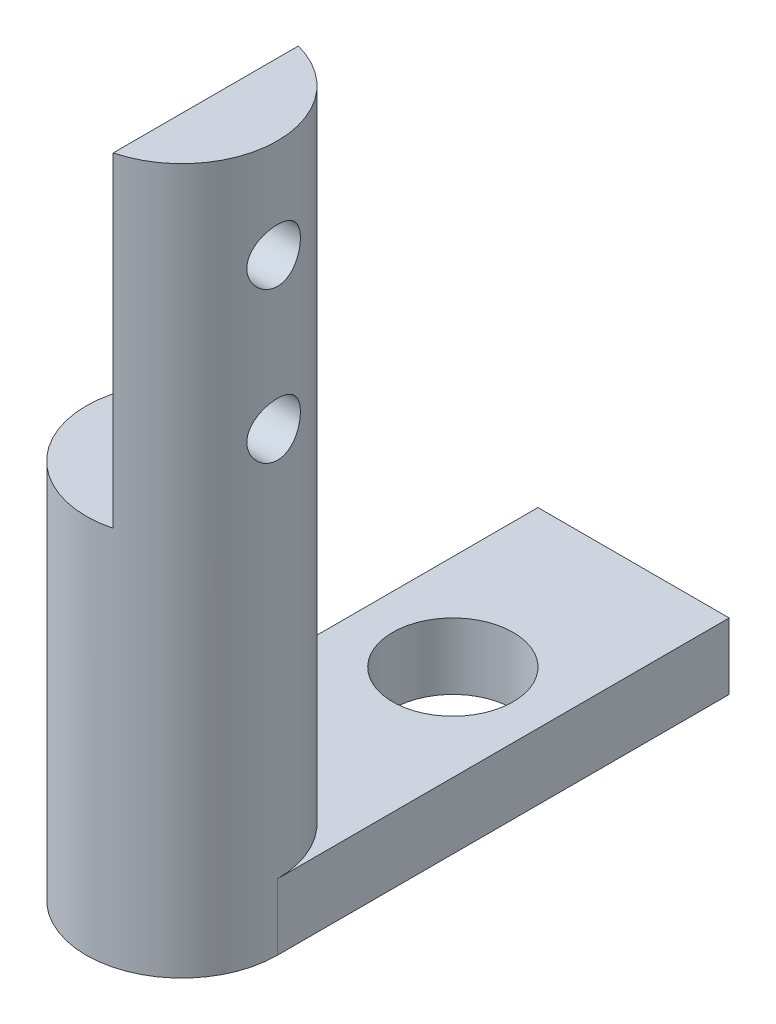
ISO-10303-21;
HEADER;
FILE_DESCRIPTION(('STEP AP214'),'2;1');
FILE_NAME('part.step','',(''),(''),'','','');
FILE_SCHEMA(('AUTOMOTIVE_DESIGN { 1 0 10303 214 1 1 1 1 }'));
ENDSEC;
DATA;
#1=APPLICATION_CONTEXT('core data for automotive mechanical design processes');
#2=APPLICATION_PROTOCOL_DEFINITION('international standard','automotive_design',2000,#1);
#3=PRODUCT_CONTEXT('',#1,'mechanical');
#4=PRODUCT('Part','Part','',(#3));
#5=PRODUCT_RELATED_PRODUCT_CATEGORY('part','',(#4));
#6=PRODUCT_DEFINITION_FORMATION('','',#4);
#7=PRODUCT_DEFINITION_CONTEXT('part definition',#1,'design');
#8=PRODUCT_DEFINITION('design','',#6,#7);
#9=PRODUCT_DEFINITION_SHAPE('','',#8);
#10=(LENGTH_UNIT() NAMED_UNIT(*) SI_UNIT(.MILLI.,.METRE.));
#11=(NAMED_UNIT(*) PLANE_ANGLE_UNIT() SI_UNIT($,.RADIAN.));
#12=(NAMED_UNIT(*) SI_UNIT($,.STERADIAN.) SOLID_ANGLE_UNIT());
#13=UNCERTAINTY_MEASURE_WITH_UNIT(LENGTH_MEASURE(1.E-05),#10,'distance_accuracy_value','');
#14=(GEOMETRIC_REPRESENTATION_CONTEXT(3) GLOBAL_UNCERTAINTY_ASSIGNED_CONTEXT((#13)) GLOBAL_UNIT_ASSIGNED_CONTEXT((#10,
#11,#12)) REPRESENTATION_CONTEXT('',''));
#15=CARTESIAN_POINT('',(0.,0.,0.));
#16=DIRECTION('',(0.,0.,1.));
#17=DIRECTION('',(1.,0.,0.));
#18=AXIS2_PLACEMENT_3D('',#15,#16,#17);
#19=CARTESIAN_POINT('',(0.,57.15,0.));
#20=DIRECTION('',(0.,-1.,0.));
#21=DIRECTION('',(0.,0.,-1.));
#22=AXIS2_PLACEMENT_3D('',#19,#20,#21);
#23=CYLINDRICAL_SURFACE('',#22,3.175);
#24=DIRECTION('',(0.,1.,0.));
#25=VECTOR('',#24,1.);
#26=CARTESIAN_POINT('',(3.175,33.73,0.));
#27=LINE('',#26,#25);
#28=CARTESIAN_POINT('',(3.175,33.73,0.));
#29=VERTEX_POINT('',#28);
#30=CARTESIAN_POINT('',(3.175,35.93,0.));
#31=VERTEX_POINT('',#30);
#32=EDGE_CURVE('E58',#29,#31,#27,.T.);
#33=ORIENTED_EDGE('',*,*,#32,.T.);
#34=CARTESIAN_POINT('',(0.,35.93,0.));
#35=DIRECTION('',(0.,-1.,0.));
#36=DIRECTION('',(0.,0.,-1.));
#37=AXIS2_PLACEMENT_3D('',#34,#35,#36);
#38=CIRCLE('',#37,3.175);
#39=CARTESIAN_POINT('',(-3.175,35.93,0.));
#40=VERTEX_POINT('',#39);
#41=EDGE_CURVE('E11',#40,#31,#38,.T.);
#42=ORIENTED_EDGE('',*,*,#41,.F.);
#43=DIRECTION('',(0.,1.,0.));
#44=VECTOR('',#43,1.);
#45=CARTESIAN_POINT('',(-3.175,33.73,0.));
#46=LINE('',#45,#44);
#47=CARTESIAN_POINT('',(-3.175,33.73,0.));
#48=VERTEX_POINT('',#47);
#49=EDGE_CURVE('E51',#48,#40,#46,.T.);
#50=ORIENTED_EDGE('',*,*,#49,.F.);
#51=CARTESIAN_POINT('',(0.,33.73,0.));
#52=DIRECTION('',(0.,-1.,0.));
#53=DIRECTION('',(0.,0.,-1.));
#54=AXIS2_PLACEMENT_3D('',#51,#52,#53);
#55=CIRCLE('',#54,3.175);
#56=EDGE_CURVE('E94',#29,#48,#55,.T.);
#57=ORIENTED_EDGE('',*,*,#56,.F.);
#58=EDGE_LOOP('',(#33,#42,#50,#57));
#59=FACE_BOUND('',#58,.T.);
#60=CARTESIAN_POINT('',(3.048,53.855,0.889));
#61=CARTESIAN_POINT('',(3.04800074144579,53.9038733654637,0.888999022704975));
#62=CARTESIAN_POINT('',(3.0491883536904,53.9527567364062,0.884956005900081));
#63=CARTESIAN_POINT('',(3.05379446473852,54.0491049848988,0.86892561421158));
#64=CARTESIAN_POINT('',(3.05721393512249,54.096569235257,0.856934779420127));
#65=CARTESIAN_POINT('',(3.06586679255467,54.1886712317961,0.825439260264912));
#66=CARTESIAN_POINT('',(3.07109744934927,54.2333131134177,0.80594588062788));
#67=CARTESIAN_POINT('',(3.08277975485952,54.3187015211283,0.76003475636559));
#68=CARTESIAN_POINT('',(3.0892315334209,54.3594476322734,0.733616275257371));
#69=CARTESIAN_POINT('',(3.10282851808416,54.4370111447716,0.673825649223518));
#70=CARTESIAN_POINT('',(3.10998700385331,54.4737052421074,0.640296533333315));
#71=CARTESIAN_POINT('',(3.12407666925912,54.5410299343499,0.567573542210274));
#72=CARTESIAN_POINT('',(3.13100782316884,54.5716598449399,0.528379028524614));
#73=CARTESIAN_POINT('',(3.14401109305889,54.6265090608122,0.444574237503614));
#74=CARTESIAN_POINT('',(3.15006572408435,54.6506045660182,0.399879985189847));
#75=CARTESIAN_POINT('',(3.16048064645674,54.6908915244847,0.306876342799879));
#76=CARTESIAN_POINT('',(3.16484125401579,54.7070844530113,0.258567629420829));
#77=CARTESIAN_POINT('',(3.17128288506878,54.7307040631926,0.160994613397916));
#78=CARTESIAN_POINT('',(3.17341843142117,54.7383407786606,0.111784817223569));
#79=CARTESIAN_POINT('',(3.17536048694193,54.7452932743307,0.0127392624770647));
#80=CARTESIAN_POINT('',(3.17516742430905,54.7446105843552,-0.0370963793271483));
#81=CARTESIAN_POINT('',(3.17251342098985,54.735088882728,-0.134512605209552));
#82=CARTESIAN_POINT('',(3.17011563326432,54.7264769888744,-0.18211737468884));
#83=CARTESIAN_POINT('',(3.16339697389186,54.7017098300263,-0.275176901920622));
#84=CARTESIAN_POINT('',(3.15907598732543,54.6855541142527,-0.320631531013265));
#85=CARTESIAN_POINT('',(3.14890524255914,54.6459918167282,-0.408664749201556));
#86=CARTESIAN_POINT('',(3.14303970776309,54.6225099164607,-0.451207592285719));
#87=CARTESIAN_POINT('',(3.1304081222126,54.5690202636264,-0.531824617738516));
#88=CARTESIAN_POINT('',(3.12364188079185,54.5390111284853,-0.569897850736414));
#89=CARTESIAN_POINT('',(3.10966917671264,54.472123673229,-0.64185082699832));
#90=CARTESIAN_POINT('',(3.1024555637627,54.4350476993962,-0.675545670788159));
#91=CARTESIAN_POINT('',(3.08860471608588,54.3556980560687,-0.736287397269033));
#92=CARTESIAN_POINT('',(3.0819675243892,54.3134239991019,-0.763333783924004));
#93=CARTESIAN_POINT('',(3.06999005425627,54.2244444097016,-0.810171227980408));
#94=CARTESIAN_POINT('',(3.06465973815351,54.1777083945776,-0.829907105431936));
#95=CARTESIAN_POINT('',(3.05602075215966,54.0813941993218,-0.861178446006272));
#96=CARTESIAN_POINT('',(3.05271152110212,54.0318168122998,-0.872716185537043));
#97=CARTESIAN_POINT('',(3.04861036820764,53.9329684098257,-0.88693469934459));
#98=CARTESIAN_POINT('',(3.04773950623862,53.8837405964397,-0.889893331949965));
#99=CARTESIAN_POINT('',(3.04839680667467,53.7854926125504,-0.887639246904802));
#100=CARTESIAN_POINT('',(3.04992468355344,53.7364724180303,-0.882427501789495));
#101=CARTESIAN_POINT('',(3.0551305705055,53.6411353392666,-0.864226581903412));
#102=CARTESIAN_POINT('',(3.05876110757367,53.5947828515508,-0.851408976918569));
#103=CARTESIAN_POINT('',(3.06771577424975,53.5048869252364,-0.818555399608298));
#104=CARTESIAN_POINT('',(3.07304014129867,53.4613438814956,-0.798518415218364));
#105=CARTESIAN_POINT('',(3.08494108557681,53.3771528913416,-0.751245255343617));
#106=CARTESIAN_POINT('',(3.09154455793357,53.336599053057,-0.723848410491956));
#107=CARTESIAN_POINT('',(3.10519857691837,53.2605624680078,-0.662829100750051));
#108=CARTESIAN_POINT('',(3.11224921630329,53.2250807783703,-0.629205341400976));
#109=CARTESIAN_POINT('',(3.12627846255595,53.1590184791837,-0.555393175540642));
#110=CARTESIAN_POINT('',(3.13324740753382,53.1286329109128,-0.515027982119803));
#111=CARTESIAN_POINT('',(3.14609634169483,53.0750663487539,-0.429610615302622));
#112=CARTESIAN_POINT('',(3.15197638840411,53.0518849742268,-0.384558689701356));
#113=CARTESIAN_POINT('',(3.16194727289417,53.013604157135,-0.291361546194213));
#114=CARTESIAN_POINT('',(3.16605159772319,52.9984435908583,-0.243242948857278));
#115=CARTESIAN_POINT('',(3.17206811720327,52.9764640428509,-0.145007590278837));
#116=CARTESIAN_POINT('',(3.17398085158866,52.969643007273,-0.0948913241610756));
#117=CARTESIAN_POINT('',(3.17537031148508,52.9646756462352,0.00410257465857598));
#118=CARTESIAN_POINT('',(3.17492700643421,52.9662445579541,0.0529649880377303));
#119=CARTESIAN_POINT('',(3.17183800207679,52.9773438045136,0.149702046305526));
#120=CARTESIAN_POINT('',(3.1691924010422,52.9868737841116,0.197576735171222));
#121=CARTESIAN_POINT('',(3.16201473209881,53.0134573009097,0.290599820702145));
#122=CARTESIAN_POINT('',(3.15749847230393,53.0304478626725,0.335767515655421));
#123=CARTESIAN_POINT('',(3.14704937045711,53.071414238752,0.422636400107661));
#124=CARTESIAN_POINT('',(3.1411163150138,53.0953911054345,0.464337066141583));
#125=CARTESIAN_POINT('',(3.12825099335539,53.1504535292501,0.544392318898718));
#126=CARTESIAN_POINT('',(3.12129485795685,53.1817240427912,0.582615836411658));
#127=CARTESIAN_POINT('',(3.10725567651361,53.2501422555483,0.653368888845674));
#128=CARTESIAN_POINT('',(3.10017259641915,53.287291553173,0.68589687010055));
#129=CARTESIAN_POINT('',(3.08647631222338,53.3675262150993,0.745143293434857));
#130=CARTESIAN_POINT('',(3.07987922601124,53.4107364855654,0.771696671947966));
#131=CARTESIAN_POINT('',(3.06814009982461,53.5011873096254,0.817126280627679));
#132=CARTESIAN_POINT('',(3.06299720300363,53.5484254684335,0.836007034585141));
#133=CARTESIAN_POINT('',(3.05538486849526,53.638669406351,0.863376907077115));
#134=CARTESIAN_POINT('',(3.05263934900825,53.6813225211211,0.872961556556881));
#135=CARTESIAN_POINT('',(3.0489467122479,53.7676478578347,0.885773084342433));
#136=CARTESIAN_POINT('',(3.04799933734046,53.8113199328759,0.889000873447365));
#137=CARTESIAN_POINT('',(3.048,53.855,0.889));
#138=B_SPLINE_CURVE_WITH_KNOTS('',3,(#60,#61,#62,#63,#64,#65,#66,#67,#68,#69,#70,#71,#72,#73,
#74,#75,#76,#77,#78,#79,#80,#81,#82,#83,#84,#85,#86,#87,#88,#89,#90,#91,#92,#93,#94,#95,#96,#97,
#98,#99,#100,#101,#102,#103,#104,#105,#106,#107,#108,#109,#110,#111,#112,#113,#114,#115,#116,
#117,#118,#119,#120,#121,#122,#123,#124,#125,#126,#127,#128,#129,#130,#131,#132,#133,#134,#135,
#136,#137),.UNSPECIFIED.,.T.,.F.,(4,2,2,2,2,2,2,2,2,2,2,2,2,2,2,2,2,2,2,2,2,2,2,2,2,2,2,2,2,2,2,
2,2,2,2,2,2,2,4),(0.,0.146459287401067,0.292982374544872,0.439285541729908,0.585604274540455,
0.735571650820734,0.885555940626635,1.03820968127062,1.19083491334784,1.33962536162133,
1.48838844982117,1.63301874819051,1.77765769001139,1.92383555425299,2.07004441154515,
2.22118784811517,2.37234255795564,2.52461599929672,2.6768471417545,2.82408956362908,
2.97131446029551,3.1153382232534,3.25938218435847,3.40687004300796,3.55438859610561,
3.70666622842306,3.85893581366485,4.01002765448382,4.1610822771287,4.30704320227681,
4.45299761463259,4.59774301104066,4.7425102221143,4.89144959773006,5.04042953893497,
5.19312385990269,5.3457280209917,5.47664325964223,5.60753973963556),.UNSPECIFIED.);
#139=CARTESIAN_POINT('',(3.048,53.855,0.889));
#140=VERTEX_POINT('',#139);
#141=EDGE_CURVE('E123',#140,#140,#138,.T.);
#142=ORIENTED_EDGE('',*,*,#141,.T.);
#143=EDGE_LOOP('',(#142));
#144=FACE_BOUND('',#143,.T.);
#145=CARTESIAN_POINT('',(3.048,48.855,0.889));
#146=CARTESIAN_POINT('',(3.04800074144579,48.9038733654637,0.888999022704976));
#147=CARTESIAN_POINT('',(3.0491883536904,48.9527567364062,0.884956005900081));
#148=CARTESIAN_POINT('',(3.05379446473852,49.0491049848988,0.868925614211581));
#149=CARTESIAN_POINT('',(3.05721393512249,49.096569235257,0.856934779420127));
#150=CARTESIAN_POINT('',(3.06586679255467,49.1886712317961,0.825439260264913));
#151=CARTESIAN_POINT('',(3.07109744934927,49.2333131134177,0.80594588062788));
#152=CARTESIAN_POINT('',(3.08277975485952,49.3187015211283,0.760034756365591));
#153=CARTESIAN_POINT('',(3.0892315334209,49.3594476322734,0.733616275257372));
#154=CARTESIAN_POINT('',(3.10282851808416,49.4370111447716,0.673825649223519));
#155=CARTESIAN_POINT('',(3.10998700385331,49.4737052421073,0.640296533333315));
#156=CARTESIAN_POINT('',(3.12407666925912,49.5410299343499,0.567573542210273));
#157=CARTESIAN_POINT('',(3.13100782316884,49.5716598449399,0.528379028524615));
#158=CARTESIAN_POINT('',(3.14401109305889,49.6265090608122,0.444574237503616));
#159=CARTESIAN_POINT('',(3.15006572408435,49.6506045660182,0.399879985189847));
#160=CARTESIAN_POINT('',(3.16048064645674,49.6908915244846,0.306876342799879));
#161=CARTESIAN_POINT('',(3.16484125401579,49.7070844530113,0.25856762942083));
#162=CARTESIAN_POINT('',(3.17128288506878,49.7307040631926,0.160994613397917));
#163=CARTESIAN_POINT('',(3.17341843142117,49.7383407786606,0.111784817223569));
#164=CARTESIAN_POINT('',(3.17536048694193,49.7452932743306,0.0127392624770652));
#165=CARTESIAN_POINT('',(3.17516742430905,49.7446105843552,-0.0370963793271478));
#166=CARTESIAN_POINT('',(3.17251342098985,49.735088882728,-0.134512605209552));
#167=CARTESIAN_POINT('',(3.17011563326432,49.7264769888744,-0.182117374688842));
#168=CARTESIAN_POINT('',(3.16339697389186,49.7017098300263,-0.275176901920624));
#169=CARTESIAN_POINT('',(3.15907598732543,49.6855541142527,-0.320631531013265));
#170=CARTESIAN_POINT('',(3.14890524255914,49.6459918167282,-0.408664749201556));
#171=CARTESIAN_POINT('',(3.14303970776309,49.6225099164607,-0.451207592285721));
#172=CARTESIAN_POINT('',(3.1304081222126,49.5690202636264,-0.531824617738518));
#173=CARTESIAN_POINT('',(3.12364188079185,49.5390111284853,-0.569897850736415));
#174=CARTESIAN_POINT('',(3.10966917671264,49.472123673229,-0.641850826998317));
#175=CARTESIAN_POINT('',(3.1024555637627,49.4350476993962,-0.675545670788154));
#176=CARTESIAN_POINT('',(3.08860471608588,49.3556980560687,-0.736287397269028));
#177=CARTESIAN_POINT('',(3.0819675243892,49.3134239991019,-0.763333783924003));
#178=CARTESIAN_POINT('',(3.06999005425627,49.2244444097016,-0.810171227980407));
#179=CARTESIAN_POINT('',(3.06465973815351,49.1777083945775,-0.829907105431934));
#180=CARTESIAN_POINT('',(3.05602075215966,49.0813941993218,-0.86117844600627));
#181=CARTESIAN_POINT('',(3.05271152110212,49.0318168122998,-0.872716185537042));
#182=CARTESIAN_POINT('',(3.04861036820764,48.9329684098257,-0.88693469934459));
#183=CARTESIAN_POINT('',(3.04773950623862,48.8837405964397,-0.889893331949965));
#184=CARTESIAN_POINT('',(3.04839680667467,48.7854926125504,-0.887639246904802));
#185=CARTESIAN_POINT('',(3.04992468355344,48.7364724180303,-0.882427501789494));
#186=CARTESIAN_POINT('',(3.0551305705055,48.6411353392666,-0.864226581903411));
#187=CARTESIAN_POINT('',(3.05876110757367,48.5947828515507,-0.851408976918569));
#188=CARTESIAN_POINT('',(3.06771577424975,48.5048869252364,-0.818555399608297));
#189=CARTESIAN_POINT('',(3.07304014129867,48.4613438814956,-0.798518415218363));
#190=CARTESIAN_POINT('',(3.08494108557681,48.3771528913416,-0.751245255343617));
#191=CARTESIAN_POINT('',(3.09154455793357,48.336599053057,-0.723848410491955));
#192=CARTESIAN_POINT('',(3.10519857691837,48.2605624680078,-0.66282910075005));
#193=CARTESIAN_POINT('',(3.11224921630329,48.2250807783703,-0.629205341400975));
#194=CARTESIAN_POINT('',(3.12627846255595,48.1590184791837,-0.555393175540641));
#195=CARTESIAN_POINT('',(3.13324740753382,48.1286329109128,-0.515027982119802));
#196=CARTESIAN_POINT('',(3.14609634169483,48.0750663487539,-0.429610615302621));
#197=CARTESIAN_POINT('',(3.15197638840411,48.0518849742268,-0.384558689701355));
#198=CARTESIAN_POINT('',(3.16194727289417,48.013604157135,-0.291361546194213));
#199=CARTESIAN_POINT('',(3.16605159772319,47.9984435908583,-0.243242948857277));
#200=CARTESIAN_POINT('',(3.17206811720327,47.9764640428509,-0.145007590278837));
#201=CARTESIAN_POINT('',(3.17398085158866,47.969643007273,-0.094891324161075));
#202=CARTESIAN_POINT('',(3.17537031148508,47.9646756462352,0.00410257465857676));
#203=CARTESIAN_POINT('',(3.17492700643421,47.9662445579541,0.0529649880377312));
#204=CARTESIAN_POINT('',(3.17183800207679,47.9773438045136,0.149702046305527));
#205=CARTESIAN_POINT('',(3.1691924010422,47.9868737841116,0.197576735171222));
#206=CARTESIAN_POINT('',(3.16201473209881,48.0134573009097,0.290599820702147));
#207=CARTESIAN_POINT('',(3.15749847230393,48.0304478626725,0.335767515655424));
#208=CARTESIAN_POINT('',(3.14704937045711,48.071414238752,0.422636400107665));
#209=CARTESIAN_POINT('',(3.1411163150138,48.0953911054345,0.464337066141584));
#210=CARTESIAN_POINT('',(3.12825099335539,48.1504535292501,0.544392318898719));
#211=CARTESIAN_POINT('',(3.12129485795685,48.1817240427912,0.582615836411659));
#212=CARTESIAN_POINT('',(3.10725567651361,48.2501422555483,0.653368888845675));
#213=CARTESIAN_POINT('',(3.10017259641915,48.287291553173,0.68589687010055));
#214=CARTESIAN_POINT('',(3.08647631222338,48.3675262150993,0.745143293434857));
#215=CARTESIAN_POINT('',(3.07987922601124,48.4107364855654,0.771696671947967));
#216=CARTESIAN_POINT('',(3.0681400998246,48.5011873096253,0.817126280627679));
#217=CARTESIAN_POINT('',(3.06299720300363,48.5484254684335,0.836007034585142));
#218=CARTESIAN_POINT('',(3.05538486849526,48.638669406351,0.863376907077116));
#219=CARTESIAN_POINT('',(3.05263934900825,48.6813225211211,0.872961556556881));
#220=CARTESIAN_POINT('',(3.0489467122479,48.7676478578347,0.885773084342434));
#221=CARTESIAN_POINT('',(3.04799933734046,48.8113199328759,0.889000873447365));
#222=CARTESIAN_POINT('',(3.048,48.855,0.889));
#223=B_SPLINE_CURVE_WITH_KNOTS('',3,(#145,#146,#147,#148,#149,#150,#151,#152,#153,#154,#155,
#156,#157,#158,#159,#160,#161,#162,#163,#164,#165,#166,#167,#168,#169,#170,#171,#172,#173,#174,
#175,#176,#177,#178,#179,#180,#181,#182,#183,#184,#185,#186,#187,#188,#189,#190,#191,#192,#193,
#194,#195,#196,#197,#198,#199,#200,#201,#202,#203,#204,#205,#206,#207,#208,#209,#210,#211,#212,
#213,#214,#215,#216,#217,#218,#219,#220,#221,#222),.UNSPECIFIED.,.T.,.F.,(4,2,2,2,2,2,2,2,2,2,2,
2,2,2,2,2,2,2,2,2,2,2,2,2,2,2,2,2,2,2,2,2,2,2,2,2,2,2,4),(0.,0.146459287401067,
0.292982374544872,0.439285541729908,0.585604274540455,0.735571650820729,0.885555940626634,
1.03820968127062,1.19083491334784,1.33962536162133,1.48838844982117,1.63301874819052,
1.77765769001139,1.923835554253,2.07004441154515,2.22118784811516,2.37234255795564,
2.52461599929671,2.6768471417545,2.82408956362907,2.97131446029551,3.1153382232534,
3.25938218435847,3.40687004300796,3.55438859610561,3.70666622842306,3.85893581366485,
4.01002765448382,4.1610822771287,4.30704320227681,4.45299761463259,4.59774301104066,
4.74251022211431,4.89144959773006,5.04042953893497,5.19312385990269,5.3457280209917,
5.47664325964223,5.60753973963556),.UNSPECIFIED.);
#224=CARTESIAN_POINT('',(3.048,48.855,0.889));
#225=VERTEX_POINT('',#224);
#226=EDGE_CURVE('E115',#225,#225,#223,.T.);
#227=ORIENTED_EDGE('',*,*,#226,.T.);
#228=EDGE_LOOP('',(#227));
#229=FACE_BOUND('',#228,.T.);
#230=CARTESIAN_POINT('',(0.,57.15,0.));
#231=DIRECTION('',(0.,1.,0.));
#232=DIRECTION('',(0.,0.,1.));
#233=AXIS2_PLACEMENT_3D('',#230,#231,#232);
#234=CIRCLE('',#233,3.175);
#235=CARTESIAN_POINT('',(0.794,57.15,3.07411597048648));
#236=VERTEX_POINT('',#235);
#237=CARTESIAN_POINT('',(0.794,57.15,-3.07411597048648));
#238=VERTEX_POINT('',#237);
#239=EDGE_CURVE('E154',#236,#238,#234,.T.);
#240=ORIENTED_EDGE('',*,*,#239,.F.);
#241=DIRECTION('',(0.,-1.,0.));
#242=VECTOR('',#241,1.);
#243=CARTESIAN_POINT('',(0.794,57.15,3.07411597048648));
#244=LINE('',#243,#242);
#245=CARTESIAN_POINT('',(0.794,46.355,3.07411597048648));
#246=VERTEX_POINT('',#245);
#247=EDGE_CURVE('E161',#236,#246,#244,.T.);
#248=ORIENTED_EDGE('',*,*,#247,.T.);
#249=CARTESIAN_POINT('',(0.,46.355,0.));
#250=DIRECTION('',(0.,-1.,0.));
#251=DIRECTION('',(0.,0.,-1.));
#252=AXIS2_PLACEMENT_3D('',#249,#250,#251);
#253=CIRCLE('',#252,3.175);
#254=CARTESIAN_POINT('',(0.794,46.355,-3.07411597048648));
#255=VERTEX_POINT('',#254);
#256=EDGE_CURVE('E44',#246,#255,#253,.T.);
#257=ORIENTED_EDGE('',*,*,#256,.T.);
#258=DIRECTION('',(0.,-1.,0.));
#259=VECTOR('',#258,1.);
#260=CARTESIAN_POINT('',(0.794,57.15,-3.07411597048648));
#261=LINE('',#260,#259);
#262=EDGE_CURVE('E162',#255,#238,#261,.F.);
#263=ORIENTED_EDGE('',*,*,#262,.T.);
#264=EDGE_LOOP('',(#240,#248,#257,#263));
#265=FACE_BOUND('',#264,.T.);
#266=ADVANCED_FACE('F36',(#59,#144,#229,#265),#23,.T.);
#267=CARTESIAN_POINT('',(0.,57.15,0.));
#268=DIRECTION('',(0.,1.,0.));
#269=DIRECTION('',(0.,0.,1.));
#270=AXIS2_PLACEMENT_3D('',#267,#268,#269);
#271=PLANE('',#270);
#272=DIRECTION('',(0.,0.,-1.));
#273=VECTOR('',#272,1.);
#274=CARTESIAN_POINT('',(0.794,57.15,0.));
#275=LINE('',#274,#273);
#276=EDGE_CURVE('E152',#236,#238,#275,.T.);
#277=ORIENTED_EDGE('',*,*,#276,.F.);
#278=ORIENTED_EDGE('',*,*,#239,.T.);
#279=EDGE_LOOP('',(#277,#278));
#280=FACE_BOUND('',#279,.T.);
#281=ADVANCED_FACE('F141',(#280),#271,.T.);
#282=CARTESIAN_POINT('',(0.,46.355,0.));
#283=DIRECTION('',(0.,-1.,0.));
#284=DIRECTION('',(0.,0.,-1.));
#285=AXIS2_PLACEMENT_3D('',#282,#283,#284);
#286=PLANE('',#285);
#287=ORIENTED_EDGE('',*,*,#256,.F.);
#288=DIRECTION('',(0.,0.,-1.));
#289=VECTOR('',#288,1.);
#290=CARTESIAN_POINT('',(0.794,46.355,-3.175));
#291=LINE('',#290,#289);
#292=EDGE_CURVE('E168',#246,#255,#291,.T.);
#293=ORIENTED_EDGE('',*,*,#292,.T.);
#294=EDGE_LOOP('',(#287,#293));
#295=FACE_BOUND('',#294,.T.);
#296=ADVANCED_FACE('F138',(#295),#286,.F.);
#297=CARTESIAN_POINT('',(0.794,46.355,-3.175));
#298=DIRECTION('',(1.,0.,0.));
#299=DIRECTION('',(0.,0.,-1.));
#300=AXIS2_PLACEMENT_3D('',#297,#298,#299);
#301=PLANE('',#300);
#302=CARTESIAN_POINT('',(0.794,53.855,0.));
#303=DIRECTION('',(-1.,0.,0.));
#304=DIRECTION('',(0.,0.,1.));
#305=AXIS2_PLACEMENT_3D('',#302,#303,#304);
#306=CIRCLE('',#305,0.888999999999999);
#307=CARTESIAN_POINT('',(0.794,53.855,0.889));
#308=VERTEX_POINT('',#307);
#309=EDGE_CURVE('E108',#308,#308,#306,.T.);
#310=ORIENTED_EDGE('',*,*,#309,.F.);
#311=EDGE_LOOP('',(#310));
#312=FACE_BOUND('',#311,.T.);
#313=CARTESIAN_POINT('',(0.794,48.855,0.));
#314=DIRECTION('',(-1.,0.,0.));
#315=DIRECTION('',(0.,0.,1.));
#316=AXIS2_PLACEMENT_3D('',#313,#314,#315);
#317=CIRCLE('',#316,0.888999999999999);
#318=CARTESIAN_POINT('',(0.794,48.855,0.889));
#319=VERTEX_POINT('',#318);
#320=EDGE_CURVE('E105',#319,#319,#317,.T.);
#321=ORIENTED_EDGE('',*,*,#320,.F.);
#322=EDGE_LOOP('',(#321));
#323=FACE_BOUND('',#322,.T.);
#324=ORIENTED_EDGE('',*,*,#276,.T.);
#325=ORIENTED_EDGE('',*,*,#262,.F.);
#326=ORIENTED_EDGE('',*,*,#292,.F.);
#327=ORIENTED_EDGE('',*,*,#247,.F.);
#328=EDGE_LOOP('',(#324,#325,#326,#327));
#329=FACE_BOUND('',#328,.T.);
#330=ADVANCED_FACE('F134',(#312,#323,#329),#301,.F.);
#331=CARTESIAN_POINT('',(11.589,48.855,0.));
#332=DIRECTION('',(-1.,0.,0.));
#333=DIRECTION('',(0.,0.,1.));
#334=AXIS2_PLACEMENT_3D('',#331,#332,#333);
#335=CYLINDRICAL_SURFACE('',#334,0.888999999999999);
#336=ORIENTED_EDGE('',*,*,#320,.T.);
#337=EDGE_LOOP('',(#336));
#338=FACE_BOUND('',#337,.T.);
#339=ORIENTED_EDGE('',*,*,#226,.F.);
#340=EDGE_LOOP('',(#339));
#341=FACE_BOUND('',#340,.T.);
#342=ADVANCED_FACE('F129',(#338,#341),#335,.F.);
#343=CARTESIAN_POINT('',(11.589,53.855,0.));
#344=DIRECTION('',(-1.,0.,0.));
#345=DIRECTION('',(0.,0.,1.));
#346=AXIS2_PLACEMENT_3D('',#343,#344,#345);
#347=CYLINDRICAL_SURFACE('',#346,0.888999999999999);
#348=ORIENTED_EDGE('',*,*,#309,.T.);
#349=EDGE_LOOP('',(#348));
#350=FACE_BOUND('',#349,.T.);
#351=ORIENTED_EDGE('',*,*,#141,.F.);
#352=EDGE_LOOP('',(#351));
#353=FACE_BOUND('',#352,.T.);
#354=ADVANCED_FACE('F133',(#350,#353),#347,.F.);
#355=CARTESIAN_POINT('',(0.,33.73,0.));
#356=DIRECTION('',(0.,-1.,0.));
#357=DIRECTION('',(0.,0.,-1.));
#358=AXIS2_PLACEMENT_3D('',#355,#356,#357);
#359=PLANE('',#358);
#360=ORIENTED_EDGE('',*,*,#56,.T.);
#361=DIRECTION('',(0.,0.,-1.));
#362=VECTOR('',#361,1.);
#363=CARTESIAN_POINT('',(-3.175,33.73,-15.));
#364=LINE('',#363,#362);
#365=CARTESIAN_POINT('',(-3.175,33.73,-15.));
#366=VERTEX_POINT('',#365);
#367=EDGE_CURVE('E86',#48,#366,#364,.T.);
#368=ORIENTED_EDGE('',*,*,#367,.T.);
#369=DIRECTION('',(1.,0.,0.));
#370=VECTOR('',#369,1.);
#371=CARTESIAN_POINT('',(3.175,33.73,-15.));
#372=LINE('',#371,#370);
#373=CARTESIAN_POINT('',(3.175,33.73,-15.));
#374=VERTEX_POINT('',#373);
#375=EDGE_CURVE('E93',#366,#374,#372,.T.);
#376=ORIENTED_EDGE('',*,*,#375,.T.);
#377=DIRECTION('',(0.,0.,1.));
#378=VECTOR('',#377,1.);
#379=CARTESIAN_POINT('',(3.175,33.73,0.));
#380=LINE('',#379,#378);
#381=EDGE_CURVE('E100',#374,#29,#380,.T.);
#382=ORIENTED_EDGE('',*,*,#381,.T.);
#383=EDGE_LOOP('',(#360,#368,#376,#382));
#384=FACE_BOUND('',#383,.T.);
#385=CARTESIAN_POINT('',(0.,33.73,-9.));
#386=DIRECTION('',(0.,-1.,0.));
#387=DIRECTION('',(0.,0.,-1.));
#388=AXIS2_PLACEMENT_3D('',#385,#386,#387);
#389=CIRCLE('',#388,2.);
#390=CARTESIAN_POINT('',(0.,33.73,-11.));
#391=VERTEX_POINT('',#390);
#392=EDGE_CURVE('E275',#391,#391,#389,.T.);
#393=ORIENTED_EDGE('',*,*,#392,.F.);
#394=EDGE_LOOP('',(#393));
#395=FACE_BOUND('',#394,.T.);
#396=ADVANCED_FACE('F97',(#384,#395),#359,.T.);
#397=CARTESIAN_POINT('',(0.,35.93,0.));
#398=DIRECTION('',(0.,-1.,0.));
#399=DIRECTION('',(0.,0.,-1.));
#400=AXIS2_PLACEMENT_3D('',#397,#398,#399);
#401=PLANE('',#400);
#402=DIRECTION('',(0.,0.,-1.));
#403=VECTOR('',#402,1.);
#404=CARTESIAN_POINT('',(-3.175,35.93,-15.));
#405=LINE('',#404,#403);
#406=CARTESIAN_POINT('',(-3.175,35.93,-15.));
#407=VERTEX_POINT('',#406);
#408=EDGE_CURVE('E281',#40,#407,#405,.T.);
#409=ORIENTED_EDGE('',*,*,#408,.F.);
#410=ORIENTED_EDGE('',*,*,#41,.T.);
#411=DIRECTION('',(0.,0.,1.));
#412=VECTOR('',#411,1.);
#413=CARTESIAN_POINT('',(3.175,35.93,0.));
#414=LINE('',#413,#412);
#415=CARTESIAN_POINT('',(3.175,35.93,-15.));
#416=VERTEX_POINT('',#415);
#417=EDGE_CURVE('E101',#416,#31,#414,.T.);
#418=ORIENTED_EDGE('',*,*,#417,.F.);
#419=DIRECTION('',(1.,0.,0.));
#420=VECTOR('',#419,1.);
#421=CARTESIAN_POINT('',(3.175,35.93,-15.));
#422=LINE('',#421,#420);
#423=EDGE_CURVE('E287',#407,#416,#422,.T.);
#424=ORIENTED_EDGE('',*,*,#423,.F.);
#425=EDGE_LOOP('',(#409,#410,#418,#424));
#426=FACE_BOUND('',#425,.T.);
#427=CARTESIAN_POINT('',(0.,35.93,-9.));
#428=DIRECTION('',(0.,-1.,0.));
#429=DIRECTION('',(0.,0.,-1.));
#430=AXIS2_PLACEMENT_3D('',#427,#428,#429);
#431=CIRCLE('',#430,2.);
#432=CARTESIAN_POINT('',(0.,35.93,-11.));
#433=VERTEX_POINT('',#432);
#434=EDGE_CURVE('E278',#433,#433,#431,.T.);
#435=ORIENTED_EDGE('',*,*,#434,.T.);
#436=EDGE_LOOP('',(#435));
#437=FACE_BOUND('',#436,.T.);
#438=ADVANCED_FACE('F178',(#426,#437),#401,.F.);
#439=CARTESIAN_POINT('',(-3.175,33.73,-15.));
#440=DIRECTION('',(1.,0.,0.));
#441=DIRECTION('',(0.,0.,-1.));
#442=AXIS2_PLACEMENT_3D('',#439,#440,#441);
#443=PLANE('',#442);
#444=ORIENTED_EDGE('',*,*,#408,.T.);
#445=DIRECTION('',(0.,1.,0.));
#446=VECTOR('',#445,1.);
#447=CARTESIAN_POINT('',(-3.175,33.73,-15.));
#448=LINE('',#447,#446);
#449=EDGE_CURVE('E90',#366,#407,#448,.T.);
#450=ORIENTED_EDGE('',*,*,#449,.F.);
#451=ORIENTED_EDGE('',*,*,#367,.F.);
#452=ORIENTED_EDGE('',*,*,#49,.T.);
#453=EDGE_LOOP('',(#444,#450,#451,#452));
#454=FACE_BOUND('',#453,.T.);
#455=ADVANCED_FACE('F88',(#454),#443,.F.);
#456=CARTESIAN_POINT('',(3.175,33.73,-15.));
#457=DIRECTION('',(0.,0.,1.));
#458=DIRECTION('',(1.,0.,0.));
#459=AXIS2_PLACEMENT_3D('',#456,#457,#458);
#460=PLANE('',#459);
#461=ORIENTED_EDGE('',*,*,#423,.T.);
#462=DIRECTION('',(0.,1.,0.));
#463=VECTOR('',#462,1.);
#464=CARTESIAN_POINT('',(3.175,33.73,-15.));
#465=LINE('',#464,#463);
#466=EDGE_CURVE('E110',#374,#416,#465,.T.);
#467=ORIENTED_EDGE('',*,*,#466,.F.);
#468=ORIENTED_EDGE('',*,*,#375,.F.);
#469=ORIENTED_EDGE('',*,*,#449,.T.);
#470=EDGE_LOOP('',(#461,#467,#468,#469));
#471=FACE_BOUND('',#470,.T.);
#472=ADVANCED_FACE('F196',(#471),#460,.F.);
#473=CARTESIAN_POINT('',(3.175,33.73,0.));
#474=DIRECTION('',(-1.,0.,0.));
#475=DIRECTION('',(0.,0.,1.));
#476=AXIS2_PLACEMENT_3D('',#473,#474,#475);
#477=PLANE('',#476);
#478=ORIENTED_EDGE('',*,*,#417,.T.);
#479=ORIENTED_EDGE('',*,*,#32,.F.);
#480=ORIENTED_EDGE('',*,*,#381,.F.);
#481=ORIENTED_EDGE('',*,*,#466,.T.);
#482=EDGE_LOOP('',(#478,#479,#480,#481));
#483=FACE_BOUND('',#482,.T.);
#484=ADVANCED_FACE('F193',(#483),#477,.F.);
#485=CARTESIAN_POINT('',(0.,33.73,-9.));
#486=DIRECTION('',(0.,1.,0.));
#487=DIRECTION('',(0.,0.,1.));
#488=AXIS2_PLACEMENT_3D('',#485,#486,#487);
#489=CYLINDRICAL_SURFACE('',#488,2.);
#490=ORIENTED_EDGE('',*,*,#392,.T.);
#491=EDGE_LOOP('',(#490));
#492=FACE_BOUND('',#491,.T.);
#493=ORIENTED_EDGE('',*,*,#434,.F.);
#494=EDGE_LOOP('',(#493));
#495=FACE_BOUND('',#494,.T.);
#496=ADVANCED_FACE('F191',(#492,#495),#489,.F.);
#497=CLOSED_SHELL('',(#266,#281,#296,#330,#342,#354,#396,#438,#455,#472,#484,#496));
#498=MANIFOLD_SOLID_BREP('B2',#497);
#499=ADVANCED_BREP_SHAPE_REPRESENTATION('',(#18,#498),#14);
#500=SHAPE_DEFINITION_REPRESENTATION(#9,#499);
ENDSEC;
END-ISO-10303-21;
